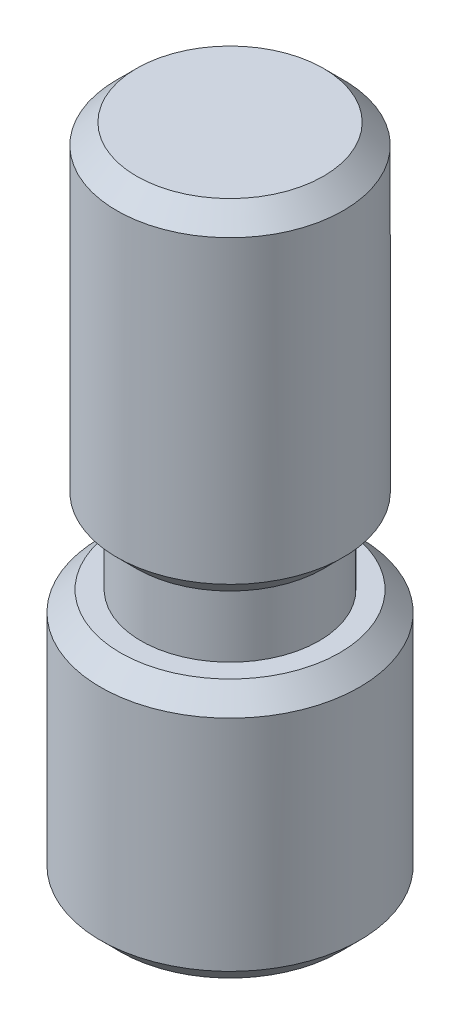
ISO-10303-21;
HEADER;
FILE_DESCRIPTION(('STEP AP214'),'2;1');
FILE_NAME('part.step','',(''),(''),'','','');
FILE_SCHEMA(('AUTOMOTIVE_DESIGN { 1 0 10303 214 1 1 1 1 }'));
ENDSEC;
DATA;
#1=APPLICATION_CONTEXT('core data for automotive mechanical design processes');
#2=APPLICATION_PROTOCOL_DEFINITION('international standard','automotive_design',2000,#1);
#3=PRODUCT_CONTEXT('',#1,'mechanical');
#4=PRODUCT('Part','Part','',(#3));
#5=PRODUCT_RELATED_PRODUCT_CATEGORY('part','',(#4));
#6=PRODUCT_DEFINITION_FORMATION('','',#4);
#7=PRODUCT_DEFINITION_CONTEXT('part definition',#1,'design');
#8=PRODUCT_DEFINITION('design','',#6,#7);
#9=PRODUCT_DEFINITION_SHAPE('','',#8);
#10=(LENGTH_UNIT() NAMED_UNIT(*) SI_UNIT(.MILLI.,.METRE.));
#11=(NAMED_UNIT(*) PLANE_ANGLE_UNIT() SI_UNIT($,.RADIAN.));
#12=(NAMED_UNIT(*) SI_UNIT($,.STERADIAN.) SOLID_ANGLE_UNIT());
#13=UNCERTAINTY_MEASURE_WITH_UNIT(LENGTH_MEASURE(1.E-05),#10,'distance_accuracy_value','');
#14=(GEOMETRIC_REPRESENTATION_CONTEXT(3) GLOBAL_UNCERTAINTY_ASSIGNED_CONTEXT((#13)) GLOBAL_UNIT_ASSIGNED_CONTEXT((#10,
#11,#12)) REPRESENTATION_CONTEXT('',''));
#15=CARTESIAN_POINT('',(0.,0.,0.));
#16=DIRECTION('',(0.,0.,1.));
#17=DIRECTION('',(1.,0.,0.));
#18=AXIS2_PLACEMENT_3D('',#15,#16,#17);
#19=CARTESIAN_POINT('',(1.15470053837921,-12.,2.));
#20=DIRECTION('',(0.,-1.,0.));
#21=DIRECTION('',(1.,0.,0.));
#22=AXIS2_PLACEMENT_3D('',#19,#20,#21);
#23=PLANE('',#22);
#24=DIRECTION('',(-1.,0.,0.));
#25=VECTOR('',#24,1.);
#26=CARTESIAN_POINT('',(-1.15470053837929,-12.,-2.));
#27=LINE('',#26,#25);
#28=CARTESIAN_POINT('',(-1.1547005383793,-12.,-2.));
#29=VERTEX_POINT('',#28);
#30=CARTESIAN_POINT('',(1.15470053837921,-12.,-2.));
#31=VERTEX_POINT('',#30);
#32=EDGE_CURVE('E104',#29,#31,#27,.F.);
#33=ORIENTED_EDGE('',*,*,#32,.T.);
#34=DIRECTION('',(-0.5,0.,-0.866025403784439));
#35=VECTOR('',#34,1.);
#36=CARTESIAN_POINT('',(1.15470053837921,-12.,-2.));
#37=LINE('',#36,#35);
#38=CARTESIAN_POINT('',(2.30940107675846,-12.,0.));
#39=VERTEX_POINT('',#38);
#40=EDGE_CURVE('E106',#31,#39,#37,.F.);
#41=ORIENTED_EDGE('',*,*,#40,.T.);
#42=DIRECTION('',(0.5,0.,-0.866025403784439));
#43=VECTOR('',#42,1.);
#44=CARTESIAN_POINT('',(2.30940107675846,-12.,0.));
#45=LINE('',#44,#43);
#46=CARTESIAN_POINT('',(1.15470053837921,-12.,2.));
#47=VERTEX_POINT('',#46);
#48=EDGE_CURVE('E108',#39,#47,#45,.F.);
#49=ORIENTED_EDGE('',*,*,#48,.T.);
#50=DIRECTION('',(1.,0.,0.));
#51=VECTOR('',#50,1.);
#52=CARTESIAN_POINT('',(1.15470053837921,-12.,2.));
#53=LINE('',#52,#51);
#54=CARTESIAN_POINT('',(-1.15470053837929,-12.,2.));
#55=VERTEX_POINT('',#54);
#56=EDGE_CURVE('E219',#47,#55,#53,.F.);
#57=ORIENTED_EDGE('',*,*,#56,.T.);
#58=DIRECTION('',(0.5,0.,0.866025403784439));
#59=VECTOR('',#58,1.);
#60=CARTESIAN_POINT('',(-1.15470053837929,-12.,2.));
#61=LINE('',#60,#59);
#62=CARTESIAN_POINT('',(-2.30940107675855,-12.,0.));
#63=VERTEX_POINT('',#62);
#64=EDGE_CURVE('E224',#55,#63,#61,.F.);
#65=ORIENTED_EDGE('',*,*,#64,.T.);
#66=DIRECTION('',(-0.5,0.,0.866025403784439));
#67=VECTOR('',#66,1.);
#68=CARTESIAN_POINT('',(-2.30940107675855,-12.,0.));
#69=LINE('',#68,#67);
#70=EDGE_CURVE('E228',#63,#29,#69,.F.);
#71=ORIENTED_EDGE('',*,*,#70,.T.);
#72=EDGE_LOOP('',(#33,#41,#49,#57,#65,#71));
#73=FACE_BOUND('',#72,.T.);
#74=ADVANCED_FACE('F17',(#73),#23,.T.);
#75=CARTESIAN_POINT('',(2.30940107675846,-12.,0.));
#76=DIRECTION('',(0.866025403784439,0.,0.5));
#77=DIRECTION('',(0.5,0.,-0.866025403784439));
#78=AXIS2_PLACEMENT_3D('',#75,#76,#77);
#79=PLANE('',#78);
#80=DIRECTION('',(0.,1.,0.));
#81=VECTOR('',#80,1.);
#82=CARTESIAN_POINT('',(1.1547005383792,-12.,2.));
#83=LINE('',#82,#81);
#84=CARTESIAN_POINT('',(1.1547005383792,-15.85,2.));
#85=VERTEX_POINT('',#84);
#86=EDGE_CURVE('E119',#85,#47,#83,.T.);
#87=ORIENTED_EDGE('',*,*,#86,.T.);
#88=ORIENTED_EDGE('',*,*,#48,.F.);
#89=DIRECTION('',(0.,1.,0.));
#90=VECTOR('',#89,1.);
#91=CARTESIAN_POINT('',(2.30940107675846,-12.,0.));
#92=LINE('',#91,#90);
#93=CARTESIAN_POINT('',(2.30940107675845,-15.85,0.));
#94=VERTEX_POINT('',#93);
#95=EDGE_CURVE('E113',#39,#94,#92,.F.);
#96=ORIENTED_EDGE('',*,*,#95,.T.);
#97=DIRECTION('',(0.499999999999999,0.,-0.866025403784439));
#98=VECTOR('',#97,1.);
#99=CARTESIAN_POINT('',(1.1547005383792,-15.85,2.));
#100=LINE('',#99,#98);
#101=EDGE_CURVE('E215',#85,#94,#100,.T.);
#102=ORIENTED_EDGE('',*,*,#101,.F.);
#103=EDGE_LOOP('',(#87,#88,#96,#102));
#104=FACE_BOUND('',#103,.T.);
#105=ADVANCED_FACE('F116',(#104),#79,.F.);
#106=CARTESIAN_POINT('',(1.15470053837921,-12.,-2.));
#107=DIRECTION('',(0.866025403784439,0.,-0.5));
#108=DIRECTION('',(-0.5,0.,-0.866025403784439));
#109=AXIS2_PLACEMENT_3D('',#106,#107,#108);
#110=PLANE('',#109);
#111=ORIENTED_EDGE('',*,*,#95,.F.);
#112=ORIENTED_EDGE('',*,*,#40,.F.);
#113=DIRECTION('',(0.,1.,0.));
#114=VECTOR('',#113,1.);
#115=CARTESIAN_POINT('',(1.15470053837921,-12.,-2.));
#116=LINE('',#115,#114);
#117=CARTESIAN_POINT('',(1.1547005383792,-15.85,-2.));
#118=VERTEX_POINT('',#117);
#119=EDGE_CURVE('E127',#31,#118,#116,.F.);
#120=ORIENTED_EDGE('',*,*,#119,.T.);
#121=DIRECTION('',(-0.499999999999999,0.,-0.866025403784439));
#122=VECTOR('',#121,1.);
#123=CARTESIAN_POINT('',(2.30940107675845,-15.85,0.));
#124=LINE('',#123,#122);
#125=EDGE_CURVE('E124',#94,#118,#124,.T.);
#126=ORIENTED_EDGE('',*,*,#125,.F.);
#127=EDGE_LOOP('',(#111,#112,#120,#126));
#128=FACE_BOUND('',#127,.T.);
#129=ADVANCED_FACE('F122',(#128),#110,.F.);
#130=CARTESIAN_POINT('',(-1.15470053837929,-12.,-2.));
#131=DIRECTION('',(0.,0.,-1.));
#132=DIRECTION('',(-1.,0.,0.));
#133=AXIS2_PLACEMENT_3D('',#130,#131,#132);
#134=PLANE('',#133);
#135=ORIENTED_EDGE('',*,*,#119,.F.);
#136=ORIENTED_EDGE('',*,*,#32,.F.);
#137=DIRECTION('',(0.,1.,0.));
#138=VECTOR('',#137,1.);
#139=CARTESIAN_POINT('',(-1.1547005383793,-12.,-2.));
#140=LINE('',#139,#138);
#141=CARTESIAN_POINT('',(-1.15470053837931,-15.85,-2.));
#142=VERTEX_POINT('',#141);
#143=EDGE_CURVE('E226',#29,#142,#140,.F.);
#144=ORIENTED_EDGE('',*,*,#143,.T.);
#145=DIRECTION('',(1.,0.,0.));
#146=VECTOR('',#145,1.);
#147=CARTESIAN_POINT('',(-4.00000000000006,-15.85,-2.));
#148=LINE('',#147,#146);
#149=EDGE_CURVE('E211',#118,#142,#148,.F.);
#150=ORIENTED_EDGE('',*,*,#149,.F.);
#151=EDGE_LOOP('',(#135,#136,#144,#150));
#152=FACE_BOUND('',#151,.T.);
#153=ADVANCED_FACE('F231',(#152),#134,.F.);
#154=CARTESIAN_POINT('',(-2.30940107675855,-12.,0.));
#155=DIRECTION('',(-0.866025403784439,0.,-0.5));
#156=DIRECTION('',(-0.5,0.,0.866025403784439));
#157=AXIS2_PLACEMENT_3D('',#154,#155,#156);
#158=PLANE('',#157);
#159=ORIENTED_EDGE('',*,*,#143,.F.);
#160=ORIENTED_EDGE('',*,*,#70,.F.);
#161=DIRECTION('',(0.,1.,0.));
#162=VECTOR('',#161,1.);
#163=CARTESIAN_POINT('',(-2.30940107675854,-12.,0.));
#164=LINE('',#163,#162);
#165=CARTESIAN_POINT('',(-2.30940107675856,-15.85,0.));
#166=VERTEX_POINT('',#165);
#167=EDGE_CURVE('E222',#63,#166,#164,.F.);
#168=ORIENTED_EDGE('',*,*,#167,.T.);
#169=DIRECTION('',(-0.5,0.,0.866025403784439));
#170=VECTOR('',#169,1.);
#171=CARTESIAN_POINT('',(-1.15470053837931,-15.85,-2.));
#172=LINE('',#171,#170);
#173=EDGE_CURVE('E208',#142,#166,#172,.T.);
#174=ORIENTED_EDGE('',*,*,#173,.F.);
#175=EDGE_LOOP('',(#159,#160,#168,#174));
#176=FACE_BOUND('',#175,.T.);
#177=ADVANCED_FACE('F248',(#176),#158,.F.);
#178=CARTESIAN_POINT('',(-1.15470053837929,-12.,2.));
#179=DIRECTION('',(-0.866025403784439,0.,0.5));
#180=DIRECTION('',(0.5,0.,0.866025403784439));
#181=AXIS2_PLACEMENT_3D('',#178,#179,#180);
#182=PLANE('',#181);
#183=ORIENTED_EDGE('',*,*,#167,.F.);
#184=ORIENTED_EDGE('',*,*,#64,.F.);
#185=DIRECTION('',(0.,1.,0.));
#186=VECTOR('',#185,1.);
#187=CARTESIAN_POINT('',(-1.15470053837929,-12.,2.));
#188=LINE('',#187,#186);
#189=CARTESIAN_POINT('',(-1.1547005383793,-15.85,2.));
#190=VERTEX_POINT('',#189);
#191=EDGE_CURVE('E217',#55,#190,#188,.F.);
#192=ORIENTED_EDGE('',*,*,#191,.T.);
#193=DIRECTION('',(0.5,0.,0.866025403784439));
#194=VECTOR('',#193,1.);
#195=CARTESIAN_POINT('',(-2.30940107675856,-15.85,0.));
#196=LINE('',#195,#194);
#197=EDGE_CURVE('E205',#166,#190,#196,.T.);
#198=ORIENTED_EDGE('',*,*,#197,.F.);
#199=EDGE_LOOP('',(#183,#184,#192,#198));
#200=FACE_BOUND('',#199,.T.);
#201=ADVANCED_FACE('F245',(#200),#182,.F.);
#202=CARTESIAN_POINT('',(1.15470053837921,-12.,2.));
#203=DIRECTION('',(0.,0.,1.));
#204=DIRECTION('',(1.,0.,0.));
#205=AXIS2_PLACEMENT_3D('',#202,#203,#204);
#206=PLANE('',#205);
#207=ORIENTED_EDGE('',*,*,#191,.F.);
#208=ORIENTED_EDGE('',*,*,#56,.F.);
#209=ORIENTED_EDGE('',*,*,#86,.F.);
#210=DIRECTION('',(1.,0.,0.));
#211=VECTOR('',#210,1.);
#212=CARTESIAN_POINT('',(-4.00000000000006,-15.85,2.));
#213=LINE('',#212,#211);
#214=EDGE_CURVE('E202',#190,#85,#213,.T.);
#215=ORIENTED_EDGE('',*,*,#214,.F.);
#216=EDGE_LOOP('',(#207,#208,#209,#215));
#217=FACE_BOUND('',#216,.T.);
#218=ADVANCED_FACE('F240',(#217),#206,.F.);
#219=CARTESIAN_POINT('',(-4.00000000000006,-15.85,2.3094010767585));
#220=DIRECTION('',(0.,-1.,0.));
#221=DIRECTION('',(1.,0.,0.));
#222=AXIS2_PLACEMENT_3D('',#219,#220,#221);
#223=PLANE('',#222);
#224=ORIENTED_EDGE('',*,*,#197,.T.);
#225=ORIENTED_EDGE('',*,*,#214,.T.);
#226=ORIENTED_EDGE('',*,*,#101,.T.);
#227=ORIENTED_EDGE('',*,*,#125,.T.);
#228=ORIENTED_EDGE('',*,*,#149,.T.);
#229=ORIENTED_EDGE('',*,*,#173,.T.);
#230=EDGE_LOOP('',(#224,#225,#226,#227,#228,#229));
#231=FACE_BOUND('',#230,.T.);
#232=DIRECTION('',(0.,0.,1.));
#233=VECTOR('',#232,1.);
#234=CARTESIAN_POINT('',(3.99999999999994,-15.85,-2.3094010767585));
#235=LINE('',#234,#233);
#236=CARTESIAN_POINT('',(3.99999999999994,-15.85,-2.3094010767585));
#237=VERTEX_POINT('',#236);
#238=CARTESIAN_POINT('',(3.99999999999994,-15.85,2.3094010767585));
#239=VERTEX_POINT('',#238);
#240=EDGE_CURVE('E190',#237,#239,#235,.T.);
#241=ORIENTED_EDGE('',*,*,#240,.T.);
#242=DIRECTION('',(0.866025403784439,0.,-0.5));
#243=VECTOR('',#242,1.);
#244=CARTESIAN_POINT('',(3.99999999999994,-15.85,2.3094010767585));
#245=LINE('',#244,#243);
#246=CARTESIAN_POINT('',(0.,-15.85,4.618802153517));
#247=VERTEX_POINT('',#246);
#248=EDGE_CURVE('E185',#239,#247,#245,.F.);
#249=ORIENTED_EDGE('',*,*,#248,.T.);
#250=DIRECTION('',(0.866025403784439,0.,0.5));
#251=VECTOR('',#250,1.);
#252=CARTESIAN_POINT('',(0.,-15.85,4.61880215351701));
#253=LINE('',#252,#251);
#254=CARTESIAN_POINT('',(-4.00000000000006,-15.85,2.3094010767585));
#255=VERTEX_POINT('',#254);
#256=EDGE_CURVE('E180',#247,#255,#253,.F.);
#257=ORIENTED_EDGE('',*,*,#256,.T.);
#258=DIRECTION('',(0.,0.,1.));
#259=VECTOR('',#258,1.);
#260=CARTESIAN_POINT('',(-4.00000000000006,-15.85,2.3094010767585));
#261=LINE('',#260,#259);
#262=CARTESIAN_POINT('',(-4.00000000000006,-15.85,-2.3094010767585));
#263=VERTEX_POINT('',#262);
#264=EDGE_CURVE('E176',#255,#263,#261,.F.);
#265=ORIENTED_EDGE('',*,*,#264,.T.);
#266=DIRECTION('',(-0.866025403784439,0.,0.5));
#267=VECTOR('',#266,1.);
#268=CARTESIAN_POINT('',(-4.00000000000006,-15.85,-2.3094010767585));
#269=LINE('',#268,#267);
#270=CARTESIAN_POINT('',(0.,-15.85,-4.61880215351701));
#271=VERTEX_POINT('',#270);
#272=EDGE_CURVE('E200',#263,#271,#269,.F.);
#273=ORIENTED_EDGE('',*,*,#272,.T.);
#274=DIRECTION('',(-0.866025403784439,0.,-0.5));
#275=VECTOR('',#274,1.);
#276=CARTESIAN_POINT('',(0.,-15.85,-4.61880215351701));
#277=LINE('',#276,#275);
#278=EDGE_CURVE('E195',#271,#237,#277,.F.);
#279=ORIENTED_EDGE('',*,*,#278,.T.);
#280=EDGE_LOOP('',(#241,#249,#257,#265,#273,#279));
#281=FACE_BOUND('',#280,.T.);
#282=ADVANCED_FACE('F235',(#231,#281),#223,.T.);
#283=CARTESIAN_POINT('',(-4.00000000000006,-15.85,-2.3094010767585));
#284=DIRECTION('',(-0.5,0.,-0.866025403784439));
#285=DIRECTION('',(-0.866025403784439,0.,0.5));
#286=AXIS2_PLACEMENT_3D('',#283,#284,#285);
#287=PLANE('',#286);
#288=DIRECTION('',(0.,1.,0.));
#289=VECTOR('',#288,1.);
#290=CARTESIAN_POINT('',(0.,-15.85,-4.61880215351702));
#291=LINE('',#290,#289);
#292=CARTESIAN_POINT('',(0.,-20.5,-4.61880215351701));
#293=VERTEX_POINT('',#292);
#294=EDGE_CURVE('E197',#293,#271,#291,.T.);
#295=ORIENTED_EDGE('',*,*,#294,.T.);
#296=ORIENTED_EDGE('',*,*,#272,.F.);
#297=DIRECTION('',(0.,-1.,0.));
#298=VECTOR('',#297,1.);
#299=CARTESIAN_POINT('',(-4.00000000000006,-15.85,-2.3094010767585));
#300=LINE('',#299,#298);
#301=CARTESIAN_POINT('',(-4.00000000000007,-20.5,-2.3094010767585));
#302=VERTEX_POINT('',#301);
#303=EDGE_CURVE('E174',#263,#302,#300,.T.);
#304=ORIENTED_EDGE('',*,*,#303,.T.);
#305=DIRECTION('',(0.866025403784438,0.,-0.500000000000001));
#306=VECTOR('',#305,1.);
#307=CARTESIAN_POINT('',(-4.00000000000007,-20.5,-2.3094010767585));
#308=LINE('',#307,#306);
#309=EDGE_CURVE('E172',#302,#293,#308,.T.);
#310=ORIENTED_EDGE('',*,*,#309,.T.);
#311=EDGE_LOOP('',(#295,#296,#304,#310));
#312=FACE_BOUND('',#311,.T.);
#313=ADVANCED_FACE('F323',(#312),#287,.F.);
#314=CARTESIAN_POINT('',(0.,-15.85,-4.61880215351701));
#315=DIRECTION('',(0.5,0.,-0.866025403784439));
#316=DIRECTION('',(-0.866025403784439,0.,-0.5));
#317=AXIS2_PLACEMENT_3D('',#314,#315,#316);
#318=PLANE('',#317);
#319=DIRECTION('',(0.,1.,0.));
#320=VECTOR('',#319,1.);
#321=CARTESIAN_POINT('',(3.99999999999994,-15.85,-2.3094010767585));
#322=LINE('',#321,#320);
#323=CARTESIAN_POINT('',(3.99999999999994,-20.5,-2.3094010767585));
#324=VERTEX_POINT('',#323);
#325=EDGE_CURVE('E192',#324,#237,#322,.T.);
#326=ORIENTED_EDGE('',*,*,#325,.T.);
#327=ORIENTED_EDGE('',*,*,#278,.F.);
#328=ORIENTED_EDGE('',*,*,#294,.F.);
#329=DIRECTION('',(0.866025403784438,0.,0.500000000000001));
#330=VECTOR('',#329,1.);
#331=CARTESIAN_POINT('',(0.,-20.5,-4.61880215351701));
#332=LINE('',#331,#330);
#333=EDGE_CURVE('E170',#293,#324,#332,.T.);
#334=ORIENTED_EDGE('',*,*,#333,.T.);
#335=EDGE_LOOP('',(#326,#327,#328,#334));
#336=FACE_BOUND('',#335,.T.);
#337=ADVANCED_FACE('F319',(#336),#318,.F.);
#338=CARTESIAN_POINT('',(3.99999999999994,-15.85,-2.3094010767585));
#339=DIRECTION('',(1.,0.,0.));
#340=DIRECTION('',(0.,1.,0.));
#341=AXIS2_PLACEMENT_3D('',#338,#339,#340);
#342=PLANE('',#341);
#343=DIRECTION('',(0.,1.,0.));
#344=VECTOR('',#343,1.);
#345=CARTESIAN_POINT('',(3.99999999999993,-15.85,2.3094010767585));
#346=LINE('',#345,#344);
#347=CARTESIAN_POINT('',(3.99999999999993,-20.5,2.3094010767585));
#348=VERTEX_POINT('',#347);
#349=EDGE_CURVE('E187',#348,#239,#346,.T.);
#350=ORIENTED_EDGE('',*,*,#349,.T.);
#351=ORIENTED_EDGE('',*,*,#240,.F.);
#352=ORIENTED_EDGE('',*,*,#325,.F.);
#353=DIRECTION('',(0.,0.,1.));
#354=VECTOR('',#353,1.);
#355=CARTESIAN_POINT('',(3.99999999999993,-20.5,0.));
#356=LINE('',#355,#354);
#357=EDGE_CURVE('E168',#324,#348,#356,.T.);
#358=ORIENTED_EDGE('',*,*,#357,.T.);
#359=EDGE_LOOP('',(#350,#351,#352,#358));
#360=FACE_BOUND('',#359,.T.);
#361=ADVANCED_FACE('F315',(#360),#342,.F.);
#362=CARTESIAN_POINT('',(3.99999999999994,-15.85,2.3094010767585));
#363=DIRECTION('',(0.5,0.,0.866025403784439));
#364=DIRECTION('',(0.866025403784439,0.,-0.5));
#365=AXIS2_PLACEMENT_3D('',#362,#363,#364);
#366=PLANE('',#365);
#367=DIRECTION('',(0.,1.,0.));
#368=VECTOR('',#367,1.);
#369=CARTESIAN_POINT('',(0.,-15.85,4.618802153517));
#370=LINE('',#369,#368);
#371=CARTESIAN_POINT('',(0.,-20.5,4.618802153517));
#372=VERTEX_POINT('',#371);
#373=EDGE_CURVE('E182',#372,#247,#370,.T.);
#374=ORIENTED_EDGE('',*,*,#373,.T.);
#375=ORIENTED_EDGE('',*,*,#248,.F.);
#376=ORIENTED_EDGE('',*,*,#349,.F.);
#377=DIRECTION('',(-0.866025403784438,0.,0.500000000000001));
#378=VECTOR('',#377,1.);
#379=CARTESIAN_POINT('',(3.99999999999993,-20.5,2.3094010767585));
#380=LINE('',#379,#378);
#381=EDGE_CURVE('E166',#348,#372,#380,.T.);
#382=ORIENTED_EDGE('',*,*,#381,.T.);
#383=EDGE_LOOP('',(#374,#375,#376,#382));
#384=FACE_BOUND('',#383,.T.);
#385=ADVANCED_FACE('F312',(#384),#366,.F.);
#386=CARTESIAN_POINT('',(0.,-15.85,4.61880215351701));
#387=DIRECTION('',(-0.5,0.,0.866025403784439));
#388=DIRECTION('',(0.866025403784439,0.,0.5));
#389=AXIS2_PLACEMENT_3D('',#386,#387,#388);
#390=PLANE('',#389);
#391=DIRECTION('',(0.,-1.,0.));
#392=VECTOR('',#391,1.);
#393=CARTESIAN_POINT('',(-4.00000000000006,-15.85,2.3094010767585));
#394=LINE('',#393,#392);
#395=CARTESIAN_POINT('',(-4.00000000000007,-20.5,2.3094010767585));
#396=VERTEX_POINT('',#395);
#397=EDGE_CURVE('E178',#396,#255,#394,.F.);
#398=ORIENTED_EDGE('',*,*,#397,.T.);
#399=ORIENTED_EDGE('',*,*,#256,.F.);
#400=ORIENTED_EDGE('',*,*,#373,.F.);
#401=DIRECTION('',(-0.866025403784438,0.,-0.500000000000001));
#402=VECTOR('',#401,1.);
#403=CARTESIAN_POINT('',(0.,-20.5,4.61880215351701));
#404=LINE('',#403,#402);
#405=EDGE_CURVE('E35',#372,#396,#404,.T.);
#406=ORIENTED_EDGE('',*,*,#405,.T.);
#407=EDGE_LOOP('',(#398,#399,#400,#406));
#408=FACE_BOUND('',#407,.T.);
#409=ADVANCED_FACE('F308',(#408),#390,.F.);
#410=CARTESIAN_POINT('',(-4.00000000000006,-15.85,2.3094010767585));
#411=DIRECTION('',(-1.,0.,0.));
#412=DIRECTION('',(0.,-1.,0.));
#413=AXIS2_PLACEMENT_3D('',#410,#411,#412);
#414=PLANE('',#413);
#415=ORIENTED_EDGE('',*,*,#303,.F.);
#416=ORIENTED_EDGE('',*,*,#264,.F.);
#417=ORIENTED_EDGE('',*,*,#397,.F.);
#418=DIRECTION('',(0.,0.,1.));
#419=VECTOR('',#418,1.);
#420=CARTESIAN_POINT('',(-4.00000000000007,-20.5,0.));
#421=LINE('',#420,#419);
#422=EDGE_CURVE('E162',#396,#302,#421,.F.);
#423=ORIENTED_EDGE('',*,*,#422,.T.);
#424=EDGE_LOOP('',(#415,#416,#417,#423));
#425=FACE_BOUND('',#424,.T.);
#426=ADVANCED_FACE('F304',(#425),#414,.F.);
#427=CARTESIAN_POINT('',(6.77299999999993,-20.5,0.));
#428=DIRECTION('',(0.,1.,0.));
#429=DIRECTION('',(-1.,0.,0.));
#430=AXIS2_PLACEMENT_3D('',#427,#428,#429);
#431=PLANE('',#430);
#432=ORIENTED_EDGE('',*,*,#405,.F.);
#433=ORIENTED_EDGE('',*,*,#381,.F.);
#434=ORIENTED_EDGE('',*,*,#357,.F.);
#435=ORIENTED_EDGE('',*,*,#333,.F.);
#436=ORIENTED_EDGE('',*,*,#309,.F.);
#437=ORIENTED_EDGE('',*,*,#422,.F.);
#438=EDGE_LOOP('',(#432,#433,#434,#435,#436,#437));
#439=FACE_BOUND('',#438,.T.);
#440=CARTESIAN_POINT('',(0.,-20.5000000000268,0.));
#441=DIRECTION('',(0.,1.,0.));
#442=DIRECTION('',(-1.,0.,0.));
#443=AXIS2_PLACEMENT_3D('',#440,#441,#442);
#444=CIRCLE('',#443,6.77300000000969);
#445=CARTESIAN_POINT('',(-6.77300000000976,-20.5000000000268,0.));
#446=VERTEX_POINT('',#445);
#447=EDGE_CURVE('E20',#446,#446,#444,.T.);
#448=ORIENTED_EDGE('',*,*,#447,.F.);
#449=EDGE_LOOP('',(#448));
#450=FACE_BOUND('',#449,.T.);
#451=ADVANCED_FACE('F300',(#439,#450),#431,.F.);
#452=CARTESIAN_POINT('',(0.,-19.2729999999983,0.));
#453=DIRECTION('',(0.,1.,0.));
#454=DIRECTION('',(-1.,0.,0.));
#455=AXIS2_PLACEMENT_3D('',#452,#453,#454);
#456=CONICAL_SURFACE('',#455,8.0000000000382,0.785398163397448);
#457=CARTESIAN_POINT('',(0.,-19.273,0.));
#458=DIRECTION('',(0.,1.,0.));
#459=DIRECTION('',(-1.,0.,0.));
#460=AXIS2_PLACEMENT_3D('',#457,#458,#459);
#461=CIRCLE('',#460,8.);
#462=CARTESIAN_POINT('',(-8.00000000000007,-19.273,0.));
#463=VERTEX_POINT('',#462);
#464=EDGE_CURVE('E148',#463,#463,#461,.T.);
#465=ORIENTED_EDGE('',*,*,#464,.F.);
#466=EDGE_LOOP('',(#465));
#467=FACE_BOUND('',#466,.T.);
#468=ORIENTED_EDGE('',*,*,#447,.T.);
#469=EDGE_LOOP('',(#468));
#470=FACE_BOUND('',#469,.T.);
#471=ADVANCED_FACE('F296',(#467,#470),#456,.T.);
#472=CARTESIAN_POINT('',(0.,-20.5,0.));
#473=DIRECTION('',(0.,1.,0.));
#474=DIRECTION('',(-1.,0.,0.));
#475=AXIS2_PLACEMENT_3D('',#472,#473,#474);
#476=CYLINDRICAL_SURFACE('',#475,8.);
#477=CARTESIAN_POINT('',(0.,-5.727,0.));
#478=DIRECTION('',(0.,-1.,0.));
#479=DIRECTION('',(0.,0.,-1.));
#480=AXIS2_PLACEMENT_3D('',#477,#478,#479);
#481=CIRCLE('',#480,8.);
#482=CARTESIAN_POINT('',(0.,-5.727,-8.));
#483=VERTEX_POINT('',#482);
#484=EDGE_CURVE('E144',#483,#483,#481,.F.);
#485=ORIENTED_EDGE('',*,*,#484,.F.);
#486=EDGE_LOOP('',(#485));
#487=FACE_BOUND('',#486,.T.);
#488=ORIENTED_EDGE('',*,*,#464,.T.);
#489=EDGE_LOOP('',(#488));
#490=FACE_BOUND('',#489,.T.);
#491=ADVANCED_FACE('F293',(#487,#490),#476,.T.);
#492=CARTESIAN_POINT('',(0.,-5.727,0.));
#493=DIRECTION('',(0.,-1.,0.));
#494=DIRECTION('',(1.,0.,0.));
#495=AXIS2_PLACEMENT_3D('',#492,#493,#494);
#496=CONICAL_SURFACE('',#495,8.,0.785398163397449);
#497=ORIENTED_EDGE('',*,*,#484,.T.);
#498=EDGE_LOOP('',(#497));
#499=FACE_BOUND('',#498,.T.);
#500=CARTESIAN_POINT('',(0.,-4.5,0.));
#501=DIRECTION('',(0.,-1.,0.));
#502=DIRECTION('',(1.,0.,0.));
#503=AXIS2_PLACEMENT_3D('',#500,#501,#502);
#504=CIRCLE('',#503,6.773);
#505=CARTESIAN_POINT('',(6.77299999999998,-4.50000000000002,0.));
#506=VERTEX_POINT('',#505);
#507=EDGE_CURVE('E142',#506,#506,#504,.T.);
#508=ORIENTED_EDGE('',*,*,#507,.T.);
#509=EDGE_LOOP('',(#508));
#510=FACE_BOUND('',#509,.T.);
#511=ADVANCED_FACE('F289',(#499,#510),#496,.T.);
#512=CARTESIAN_POINT('',(5.49999999999998,-4.50000000000003,0.));
#513=DIRECTION('',(0.,-1.,0.));
#514=DIRECTION('',(1.,0.,0.));
#515=AXIS2_PLACEMENT_3D('',#512,#513,#514);
#516=PLANE('',#515);
#517=CARTESIAN_POINT('',(0.,-4.50000000000002,0.));
#518=DIRECTION('',(0.,1.,0.));
#519=DIRECTION('',(-1.,0.,0.));
#520=AXIS2_PLACEMENT_3D('',#517,#518,#519);
#521=CIRCLE('',#520,5.5);
#522=CARTESIAN_POINT('',(-5.50000000000002,-4.5,0.));
#523=VERTEX_POINT('',#522);
#524=EDGE_CURVE('E140',#523,#523,#521,.T.);
#525=ORIENTED_EDGE('',*,*,#524,.F.);
#526=EDGE_LOOP('',(#525));
#527=FACE_BOUND('',#526,.T.);
#528=ORIENTED_EDGE('',*,*,#507,.F.);
#529=EDGE_LOOP('',(#528));
#530=FACE_BOUND('',#529,.T.);
#531=ADVANCED_FACE('F285',(#527,#530),#516,.F.);
#532=CARTESIAN_POINT('',(0.,-20.5,0.));
#533=DIRECTION('',(0.,1.,0.));
#534=DIRECTION('',(-1.,0.,0.));
#535=AXIS2_PLACEMENT_3D('',#532,#533,#534);
#536=CYLINDRICAL_SURFACE('',#535,5.5);
#537=CARTESIAN_POINT('',(0.,-0.5,0.));
#538=DIRECTION('',(0.,1.,0.));
#539=DIRECTION('',(-1.,0.,0.));
#540=AXIS2_PLACEMENT_3D('',#537,#538,#539);
#541=CIRCLE('',#540,5.5);
#542=CARTESIAN_POINT('',(-5.5,-0.499999999999981,0.));
#543=VERTEX_POINT('',#542);
#544=EDGE_CURVE('E137',#543,#543,#541,.F.);
#545=ORIENTED_EDGE('',*,*,#544,.T.);
#546=EDGE_LOOP('',(#545));
#547=FACE_BOUND('',#546,.T.);
#548=ORIENTED_EDGE('',*,*,#524,.T.);
#549=EDGE_LOOP('',(#548));
#550=FACE_BOUND('',#549,.T.);
#551=ADVANCED_FACE('F281',(#547,#550),#536,.T.);
#552=CARTESIAN_POINT('',(5.773,-0.50000000000002,0.));
#553=DIRECTION('',(0.,1.,0.));
#554=DIRECTION('',(-1.,0.,0.));
#555=AXIS2_PLACEMENT_3D('',#552,#553,#554);
#556=PLANE('',#555);
#557=ORIENTED_EDGE('',*,*,#544,.F.);
#558=EDGE_LOOP('',(#557));
#559=FACE_BOUND('',#558,.T.);
#560=CARTESIAN_POINT('',(0.,-0.50000000004502,0.));
#561=DIRECTION('',(0.,1.,0.));
#562=DIRECTION('',(-1.,0.,0.));
#563=AXIS2_PLACEMENT_3D('',#560,#561,#562);
#564=CIRCLE('',#563,5.77299999997649);
#565=CARTESIAN_POINT('',(-5.77299999997649,-0.500000000045,0.));
#566=VERTEX_POINT('',#565);
#567=EDGE_CURVE('E134',#566,#566,#564,.T.);
#568=ORIENTED_EDGE('',*,*,#567,.F.);
#569=EDGE_LOOP('',(#568));
#570=FACE_BOUND('',#569,.T.);
#571=ADVANCED_FACE('F277',(#559,#570),#556,.F.);
#572=CARTESIAN_POINT('',(0.,20.5,0.));
#573=DIRECTION('',(0.,-1.,0.));
#574=DIRECTION('',(1.,0.,0.));
#575=AXIS2_PLACEMENT_3D('',#572,#573,#574);
#576=PLANE('',#575);
#577=CARTESIAN_POINT('',(0.,20.5,0.));
#578=DIRECTION('',(0.,-1.,0.));
#579=DIRECTION('',(1.,0.,0.));
#580=AXIS2_PLACEMENT_3D('',#577,#578,#579);
#581=CIRCLE('',#580,5.773);
#582=CARTESIAN_POINT('',(5.77300000000007,20.5,0.));
#583=VERTEX_POINT('',#582);
#584=EDGE_CURVE('E131',#583,#583,#581,.T.);
#585=ORIENTED_EDGE('',*,*,#584,.F.);
#586=EDGE_LOOP('',(#585));
#587=FACE_BOUND('',#586,.T.);
#588=ADVANCED_FACE('F273',(#587),#576,.F.);
#589=CARTESIAN_POINT('',(0.,0.726999999983491,0.));
#590=DIRECTION('',(0.,1.,0.));
#591=DIRECTION('',(-1.,0.,0.));
#592=AXIS2_PLACEMENT_3D('',#589,#590,#591);
#593=CONICAL_SURFACE('',#592,7.000000000005,0.785398163397448);
#594=CARTESIAN_POINT('',(0.,0.727000000000002,0.));
#595=DIRECTION('',(0.,1.,0.));
#596=DIRECTION('',(-1.,0.,0.));
#597=AXIS2_PLACEMENT_3D('',#594,#595,#596);
#598=CIRCLE('',#597,7.);
#599=CARTESIAN_POINT('',(-7.,0.727000000000026,0.));
#600=VERTEX_POINT('',#599);
#601=EDGE_CURVE('E26',#600,#600,#598,.T.);
#602=ORIENTED_EDGE('',*,*,#601,.F.);
#603=EDGE_LOOP('',(#602));
#604=FACE_BOUND('',#603,.T.);
#605=ORIENTED_EDGE('',*,*,#567,.T.);
#606=EDGE_LOOP('',(#605));
#607=FACE_BOUND('',#606,.T.);
#608=ADVANCED_FACE('F266',(#604,#607),#593,.T.);
#609=CARTESIAN_POINT('',(0.,19.273,0.));
#610=DIRECTION('',(0.,-1.,0.));
#611=DIRECTION('',(1.,0.,0.));
#612=AXIS2_PLACEMENT_3D('',#609,#610,#611);
#613=CONICAL_SURFACE('',#612,7.,0.785398163397449);
#614=CARTESIAN_POINT('',(0.,19.273,0.));
#615=DIRECTION('',(0.,1.,0.));
#616=DIRECTION('',(-1.,0.,0.));
#617=AXIS2_PLACEMENT_3D('',#614,#615,#616);
#618=CIRCLE('',#617,7.);
#619=CARTESIAN_POINT('',(-6.99999999999993,19.273,0.));
#620=VERTEX_POINT('',#619);
#621=EDGE_CURVE('E11',#620,#620,#618,.F.);
#622=ORIENTED_EDGE('',*,*,#621,.F.);
#623=EDGE_LOOP('',(#622));
#624=FACE_BOUND('',#623,.T.);
#625=ORIENTED_EDGE('',*,*,#584,.T.);
#626=EDGE_LOOP('',(#625));
#627=FACE_BOUND('',#626,.T.);
#628=ADVANCED_FACE('F260',(#624,#627),#613,.T.);
#629=CARTESIAN_POINT('',(0.,-20.5,0.));
#630=DIRECTION('',(0.,1.,0.));
#631=DIRECTION('',(-1.,0.,0.));
#632=AXIS2_PLACEMENT_3D('',#629,#630,#631);
#633=CYLINDRICAL_SURFACE('',#632,7.);
#634=ORIENTED_EDGE('',*,*,#621,.T.);
#635=EDGE_LOOP('',(#634));
#636=FACE_BOUND('',#635,.T.);
#637=ORIENTED_EDGE('',*,*,#601,.T.);
#638=EDGE_LOOP('',(#637));
#639=FACE_BOUND('',#638,.T.);
#640=ADVANCED_FACE('F258',(#636,#639),#633,.T.);
#641=CLOSED_SHELL('',(#74,#105,#129,#153,#177,#201,#218,#282,#313,#337,#361,#385,#409,#426,#451,
#471,#491,#511,#531,#551,#571,#588,#608,#628,#640));
#642=MANIFOLD_SOLID_BREP('B1',#641);
#643=ADVANCED_BREP_SHAPE_REPRESENTATION('',(#18,#642),#14);
#644=SHAPE_DEFINITION_REPRESENTATION(#9,#643);
ENDSEC;
END-ISO-10303-21;
